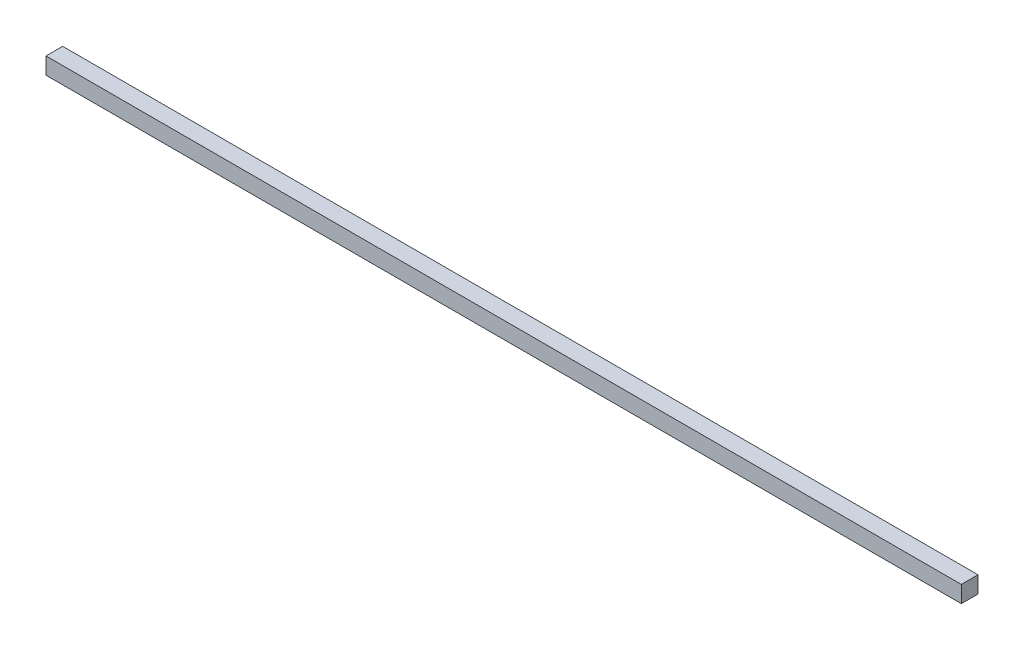
ISO-10303-21;
HEADER;
FILE_DESCRIPTION(('STEP AP214'),'2;1');
FILE_NAME('part.step','',(''),(''),'','','');
FILE_SCHEMA(('AUTOMOTIVE_DESIGN { 1 0 10303 214 1 1 1 1 }'));
ENDSEC;
DATA;
#1=APPLICATION_CONTEXT('core data for automotive mechanical design processes');
#2=APPLICATION_PROTOCOL_DEFINITION('international standard','automotive_design',2000,#1);
#3=PRODUCT_CONTEXT('',#1,'mechanical');
#4=PRODUCT('Part','Part','',(#3));
#5=PRODUCT_RELATED_PRODUCT_CATEGORY('part','',(#4));
#6=PRODUCT_DEFINITION_FORMATION('','',#4);
#7=PRODUCT_DEFINITION_CONTEXT('part definition',#1,'design');
#8=PRODUCT_DEFINITION('design','',#6,#7);
#9=PRODUCT_DEFINITION_SHAPE('','',#8);
#10=(LENGTH_UNIT() NAMED_UNIT(*) SI_UNIT(.MILLI.,.METRE.));
#11=(NAMED_UNIT(*) PLANE_ANGLE_UNIT() SI_UNIT($,.RADIAN.));
#12=(NAMED_UNIT(*) SI_UNIT($,.STERADIAN.) SOLID_ANGLE_UNIT());
#13=UNCERTAINTY_MEASURE_WITH_UNIT(LENGTH_MEASURE(1.E-05),#10,'distance_accuracy_value','');
#14=(GEOMETRIC_REPRESENTATION_CONTEXT(3) GLOBAL_UNCERTAINTY_ASSIGNED_CONTEXT((#13)) GLOBAL_UNIT_ASSIGNED_CONTEXT((#10,
#11,#12)) REPRESENTATION_CONTEXT('',''));
#15=CARTESIAN_POINT('',(0.,0.,0.));
#16=DIRECTION('',(0.,0.,1.));
#17=DIRECTION('',(1.,0.,0.));
#18=AXIS2_PLACEMENT_3D('',#15,#16,#17);
#19=CARTESIAN_POINT('',(-274.265,10.,-4.99999999999998));
#20=DIRECTION('',(1.,0.,0.));
#21=DIRECTION('',(0.,0.,-1.));
#22=AXIS2_PLACEMENT_3D('',#19,#20,#21);
#23=PLANE('',#22);
#24=DIRECTION('',(0.,0.,1.));
#25=VECTOR('',#24,1.);
#26=CARTESIAN_POINT('',(-274.265,0.,-4.99999999999998));
#27=LINE('',#26,#25);
#28=CARTESIAN_POINT('',(-274.265,0.,-4.99999999999998));
#29=VERTEX_POINT('',#28);
#30=CARTESIAN_POINT('',(-274.265,0.,5.00000000000002));
#31=VERTEX_POINT('',#30);
#32=EDGE_CURVE('E97',#29,#31,#27,.T.);
#33=ORIENTED_EDGE('',*,*,#32,.T.);
#34=DIRECTION('',(0.,-1.,0.));
#35=VECTOR('',#34,1.);
#36=CARTESIAN_POINT('',(-274.265,10.,5.00000000000002));
#37=LINE('',#36,#35);
#38=CARTESIAN_POINT('',(-274.265,10.,5.00000000000002));
#39=VERTEX_POINT('',#38);
#40=EDGE_CURVE('E11',#39,#31,#37,.T.);
#41=ORIENTED_EDGE('',*,*,#40,.F.);
#42=DIRECTION('',(0.,0.,1.));
#43=VECTOR('',#42,1.);
#44=CARTESIAN_POINT('',(-274.265,10.,-4.99999999999998));
#45=LINE('',#44,#43);
#46=CARTESIAN_POINT('',(-274.265,10.,-4.99999999999998));
#47=VERTEX_POINT('',#46);
#48=EDGE_CURVE('E85',#47,#39,#45,.T.);
#49=ORIENTED_EDGE('',*,*,#48,.F.);
#50=DIRECTION('',(0.,-1.,0.));
#51=VECTOR('',#50,1.);
#52=CARTESIAN_POINT('',(-274.265,10.,-4.99999999999998));
#53=LINE('',#52,#51);
#54=EDGE_CURVE('E93',#47,#29,#53,.T.);
#55=ORIENTED_EDGE('',*,*,#54,.T.);
#56=EDGE_LOOP('',(#33,#41,#49,#55));
#57=FACE_BOUND('',#56,.T.);
#58=ADVANCED_FACE('F34',(#57),#23,.F.);
#59=CARTESIAN_POINT('',(-274.265,10.,5.00000000000002));
#60=DIRECTION('',(0.,0.,-1.));
#61=DIRECTION('',(-1.,0.,0.));
#62=AXIS2_PLACEMENT_3D('',#59,#60,#61);
#63=PLANE('',#62);
#64=DIRECTION('',(1.,0.,0.));
#65=VECTOR('',#64,1.);
#66=CARTESIAN_POINT('',(-274.265,0.,5.00000000000002));
#67=LINE('',#66,#65);
#68=CARTESIAN_POINT('',(274.265,0.,5.00000000000002));
#69=VERTEX_POINT('',#68);
#70=EDGE_CURVE('E89',#31,#69,#67,.T.);
#71=ORIENTED_EDGE('',*,*,#70,.T.);
#72=DIRECTION('',(0.,-1.,0.));
#73=VECTOR('',#72,1.);
#74=CARTESIAN_POINT('',(274.265,10.,5.00000000000002));
#75=LINE('',#74,#73);
#76=CARTESIAN_POINT('',(274.265,10.,5.00000000000002));
#77=VERTEX_POINT('',#76);
#78=EDGE_CURVE('E42',#77,#69,#75,.T.);
#79=ORIENTED_EDGE('',*,*,#78,.F.);
#80=DIRECTION('',(1.,0.,0.));
#81=VECTOR('',#80,1.);
#82=CARTESIAN_POINT('',(-274.265,10.,5.00000000000002));
#83=LINE('',#82,#81);
#84=EDGE_CURVE('E80',#39,#77,#83,.T.);
#85=ORIENTED_EDGE('',*,*,#84,.F.);
#86=ORIENTED_EDGE('',*,*,#40,.T.);
#87=EDGE_LOOP('',(#71,#79,#85,#86));
#88=FACE_BOUND('',#87,.T.);
#89=ADVANCED_FACE('F88',(#88),#63,.F.);
#90=CARTESIAN_POINT('',(274.265,10.,-4.99999999999998));
#91=DIRECTION('',(-1.,0.,0.));
#92=DIRECTION('',(0.,0.,1.));
#93=AXIS2_PLACEMENT_3D('',#90,#91,#92);
#94=PLANE('',#93);
#95=DIRECTION('',(0.,0.,-1.));
#96=VECTOR('',#95,1.);
#97=CARTESIAN_POINT('',(274.265,0.,-4.99999999999998));
#98=LINE('',#97,#96);
#99=CARTESIAN_POINT('',(274.265,0.,-4.99999999999998));
#100=VERTEX_POINT('',#99);
#101=EDGE_CURVE('E67',#69,#100,#98,.T.);
#102=ORIENTED_EDGE('',*,*,#101,.T.);
#103=DIRECTION('',(0.,-1.,0.));
#104=VECTOR('',#103,1.);
#105=CARTESIAN_POINT('',(274.265,10.,-4.99999999999998));
#106=LINE('',#105,#104);
#107=CARTESIAN_POINT('',(274.265,10.,-4.99999999999998));
#108=VERTEX_POINT('',#107);
#109=EDGE_CURVE('E90',#108,#100,#106,.T.);
#110=ORIENTED_EDGE('',*,*,#109,.F.);
#111=DIRECTION('',(0.,0.,-1.));
#112=VECTOR('',#111,1.);
#113=CARTESIAN_POINT('',(274.265,10.,-4.99999999999998));
#114=LINE('',#113,#112);
#115=EDGE_CURVE('E83',#77,#108,#114,.T.);
#116=ORIENTED_EDGE('',*,*,#115,.F.);
#117=ORIENTED_EDGE('',*,*,#78,.T.);
#118=EDGE_LOOP('',(#102,#110,#116,#117));
#119=FACE_BOUND('',#118,.T.);
#120=ADVANCED_FACE('F91',(#119),#94,.F.);
#121=CARTESIAN_POINT('',(-274.265,10.,-4.99999999999998));
#122=DIRECTION('',(0.,0.,1.));
#123=DIRECTION('',(1.,0.,0.));
#124=AXIS2_PLACEMENT_3D('',#121,#122,#123);
#125=PLANE('',#124);
#126=DIRECTION('',(-1.,0.,0.));
#127=VECTOR('',#126,1.);
#128=CARTESIAN_POINT('',(-274.265,0.,-4.99999999999998));
#129=LINE('',#128,#127);
#130=EDGE_CURVE('E73',#100,#29,#129,.T.);
#131=ORIENTED_EDGE('',*,*,#130,.T.);
#132=ORIENTED_EDGE('',*,*,#54,.F.);
#133=DIRECTION('',(-1.,0.,0.));
#134=VECTOR('',#133,1.);
#135=CARTESIAN_POINT('',(-274.265,10.,-4.99999999999998));
#136=LINE('',#135,#134);
#137=EDGE_CURVE('E50',#108,#47,#136,.T.);
#138=ORIENTED_EDGE('',*,*,#137,.F.);
#139=ORIENTED_EDGE('',*,*,#109,.T.);
#140=EDGE_LOOP('',(#131,#132,#138,#139));
#141=FACE_BOUND('',#140,.T.);
#142=ADVANCED_FACE('F104',(#141),#125,.F.);
#143=CARTESIAN_POINT('',(0.,10.,0.));
#144=DIRECTION('',(0.,1.,0.));
#145=DIRECTION('',(0.,0.,1.));
#146=AXIS2_PLACEMENT_3D('',#143,#144,#145);
#147=PLANE('',#146);
#148=ORIENTED_EDGE('',*,*,#48,.T.);
#149=ORIENTED_EDGE('',*,*,#84,.T.);
#150=ORIENTED_EDGE('',*,*,#115,.T.);
#151=ORIENTED_EDGE('',*,*,#137,.T.);
#152=EDGE_LOOP('',(#148,#149,#150,#151));
#153=FACE_BOUND('',#152,.T.);
#154=ADVANCED_FACE('F81',(#153),#147,.T.);
#155=CARTESIAN_POINT('',(0.,0.,0.));
#156=DIRECTION('',(0.,1.,0.));
#157=DIRECTION('',(0.,0.,1.));
#158=AXIS2_PLACEMENT_3D('',#155,#156,#157);
#159=PLANE('',#158);
#160=ORIENTED_EDGE('',*,*,#32,.F.);
#161=ORIENTED_EDGE('',*,*,#130,.F.);
#162=ORIENTED_EDGE('',*,*,#101,.F.);
#163=ORIENTED_EDGE('',*,*,#70,.F.);
#164=EDGE_LOOP('',(#160,#161,#162,#163));
#165=FACE_BOUND('',#164,.T.);
#166=ADVANCED_FACE('F107',(#165),#159,.F.);
#167=CLOSED_SHELL('',(#58,#89,#120,#142,#154,#166));
#168=MANIFOLD_SOLID_BREP('B2',#167);
#169=ADVANCED_BREP_SHAPE_REPRESENTATION('',(#18,#168),#14);
#170=SHAPE_DEFINITION_REPRESENTATION(#9,#169);
ENDSEC;
END-ISO-10303-21;
